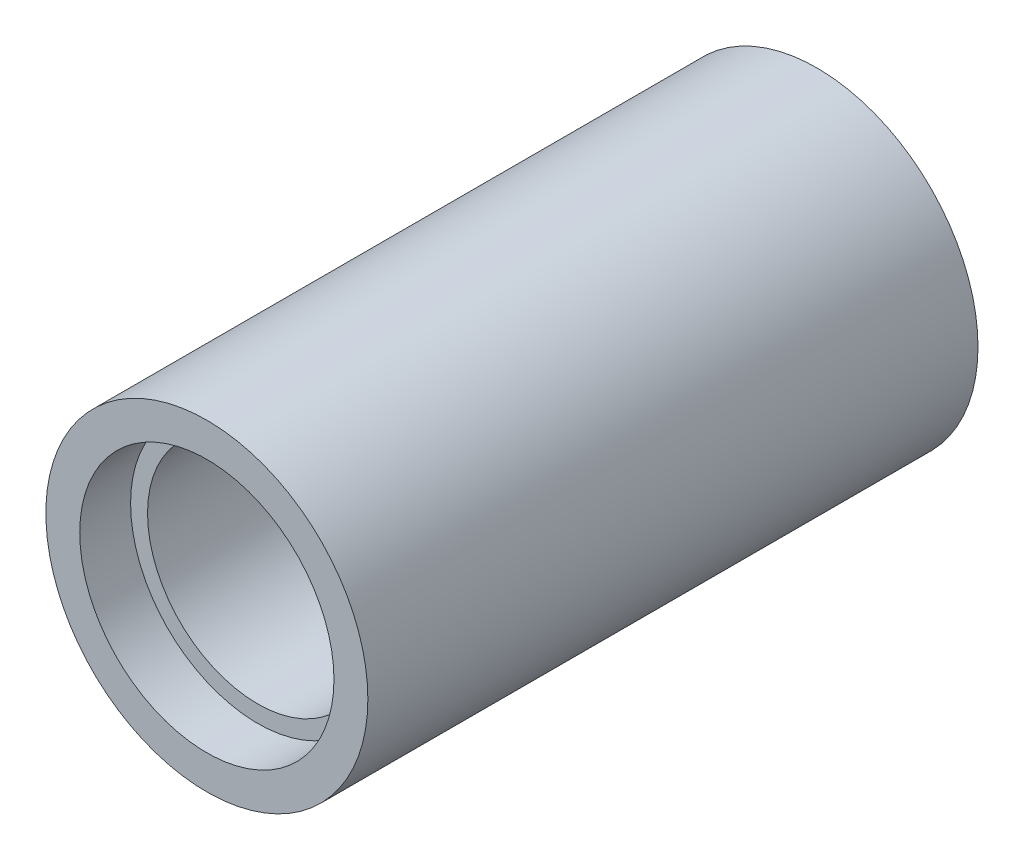
ISO-10303-21;
HEADER;
FILE_DESCRIPTION(('STEP AP214'),'2;1');
FILE_NAME('part.step','',(''),(''),'','','');
FILE_SCHEMA(('AUTOMOTIVE_DESIGN { 1 0 10303 214 1 1 1 1 }'));
ENDSEC;
DATA;
#1=APPLICATION_CONTEXT('core data for automotive mechanical design processes');
#2=APPLICATION_PROTOCOL_DEFINITION('international standard','automotive_design',2000,#1);
#3=PRODUCT_CONTEXT('',#1,'mechanical');
#4=PRODUCT('Part','Part','',(#3));
#5=PRODUCT_RELATED_PRODUCT_CATEGORY('part','',(#4));
#6=PRODUCT_DEFINITION_FORMATION('','',#4);
#7=PRODUCT_DEFINITION_CONTEXT('part definition',#1,'design');
#8=PRODUCT_DEFINITION('design','',#6,#7);
#9=PRODUCT_DEFINITION_SHAPE('','',#8);
#10=(LENGTH_UNIT() NAMED_UNIT(*) SI_UNIT(.MILLI.,.METRE.));
#11=(NAMED_UNIT(*) PLANE_ANGLE_UNIT() SI_UNIT($,.RADIAN.));
#12=(NAMED_UNIT(*) SI_UNIT($,.STERADIAN.) SOLID_ANGLE_UNIT());
#13=UNCERTAINTY_MEASURE_WITH_UNIT(LENGTH_MEASURE(1.E-05),#10,'distance_accuracy_value','');
#14=(GEOMETRIC_REPRESENTATION_CONTEXT(3) GLOBAL_UNCERTAINTY_ASSIGNED_CONTEXT((#13)) GLOBAL_UNIT_ASSIGNED_CONTEXT((#10,
#11,#12)) REPRESENTATION_CONTEXT('',''));
#15=CARTESIAN_POINT('',(0.,0.,0.));
#16=DIRECTION('',(0.,0.,1.));
#17=DIRECTION('',(1.,0.,0.));
#18=AXIS2_PLACEMENT_3D('',#15,#16,#17);
#19=CARTESIAN_POINT('',(0.,7.35,45.));
#20=DIRECTION('',(0.,0.,-1.));
#21=DIRECTION('',(-1.,0.,0.));
#22=AXIS2_PLACEMENT_3D('',#19,#20,#21);
#23=PLANE('',#22);
#24=CARTESIAN_POINT('',(0.,0.,45.));
#25=DIRECTION('',(0.,0.,-1.));
#26=DIRECTION('',(-1.,0.,0.));
#27=AXIS2_PLACEMENT_3D('',#24,#25,#26);
#28=CIRCLE('',#27,6.5);
#29=CARTESIAN_POINT('',(-6.49999999999999,0.,45.));
#30=VERTEX_POINT('',#29);
#31=EDGE_CURVE('E63',#30,#30,#28,.T.);
#32=ORIENTED_EDGE('',*,*,#31,.T.);
#33=EDGE_LOOP('',(#32));
#34=FACE_BOUND('',#33,.T.);
#35=CARTESIAN_POINT('',(0.,0.,45.));
#36=DIRECTION('',(0.,0.,-1.));
#37=DIRECTION('',(-1.,0.,0.));
#38=AXIS2_PLACEMENT_3D('',#35,#36,#37);
#39=CIRCLE('',#38,7.5);
#40=CARTESIAN_POINT('',(-7.49999999999999,0.,45.));
#41=VERTEX_POINT('',#40);
#42=EDGE_CURVE('E10',#41,#41,#39,.T.);
#43=ORIENTED_EDGE('',*,*,#42,.F.);
#44=EDGE_LOOP('',(#43));
#45=FACE_BOUND('',#44,.T.);
#46=ADVANCED_FACE('F39',(#34,#45),#23,.F.);
#47=CARTESIAN_POINT('',(0.,0.,41.8700576850888));
#48=DIRECTION('',(0.,0.,-1.));
#49=DIRECTION('',(-1.,0.,0.));
#50=AXIS2_PLACEMENT_3D('',#47,#48,#49);
#51=CYLINDRICAL_SURFACE('',#50,9.5);
#52=CARTESIAN_POINT('',(0.,0.,12.));
#53=DIRECTION('',(0.,0.,1.));
#54=DIRECTION('',(1.,0.,0.));
#55=AXIS2_PLACEMENT_3D('',#52,#53,#54);
#56=CIRCLE('',#55,9.5);
#57=CARTESIAN_POINT('',(9.50000000000001,0.,12.));
#58=VERTEX_POINT('',#57);
#59=EDGE_CURVE('E47',#58,#58,#56,.T.);
#60=ORIENTED_EDGE('',*,*,#59,.T.);
#61=EDGE_LOOP('',(#60));
#62=FACE_BOUND('',#61,.T.);
#63=CARTESIAN_POINT('',(0.,0.,48.));
#64=DIRECTION('',(0.,0.,1.));
#65=DIRECTION('',(1.,0.,0.));
#66=AXIS2_PLACEMENT_3D('',#63,#64,#65);
#67=CIRCLE('',#66,9.5);
#68=CARTESIAN_POINT('',(9.50000000000001,0.,48.));
#69=VERTEX_POINT('',#68);
#70=EDGE_CURVE('E58',#69,#69,#67,.F.);
#71=ORIENTED_EDGE('',*,*,#70,.T.);
#72=EDGE_LOOP('',(#71));
#73=FACE_BOUND('',#72,.T.);
#74=ADVANCED_FACE('F41',(#62,#73),#51,.T.);
#75=CARTESIAN_POINT('',(0.,0.,12.));
#76=DIRECTION('',(0.,0.,1.));
#77=DIRECTION('',(1.,0.,0.));
#78=AXIS2_PLACEMENT_3D('',#75,#76,#77);
#79=PLANE('',#78);
#80=ORIENTED_EDGE('',*,*,#59,.F.);
#81=EDGE_LOOP('',(#80));
#82=FACE_BOUND('',#81,.T.);
#83=CARTESIAN_POINT('',(0.,0.,12.));
#84=DIRECTION('',(0.,0.,1.));
#85=DIRECTION('',(1.,0.,0.));
#86=AXIS2_PLACEMENT_3D('',#83,#84,#85);
#87=CIRCLE('',#86,7.5);
#88=CARTESIAN_POINT('',(7.50000000000001,0.,12.));
#89=VERTEX_POINT('',#88);
#90=EDGE_CURVE('E52',#89,#89,#87,.T.);
#91=ORIENTED_EDGE('',*,*,#90,.T.);
#92=EDGE_LOOP('',(#91));
#93=FACE_BOUND('',#92,.T.);
#94=ADVANCED_FACE('F87',(#82,#93),#79,.F.);
#95=CARTESIAN_POINT('',(0.,0.,41.8700576850888));
#96=DIRECTION('',(0.,0.,-1.));
#97=DIRECTION('',(-1.,0.,0.));
#98=AXIS2_PLACEMENT_3D('',#95,#96,#97);
#99=CYLINDRICAL_SURFACE('',#98,7.5);
#100=ORIENTED_EDGE('',*,*,#90,.F.);
#101=EDGE_LOOP('',(#100));
#102=FACE_BOUND('',#101,.T.);
#103=CARTESIAN_POINT('',(0.,0.,15.));
#104=DIRECTION('',(0.,0.,1.));
#105=DIRECTION('',(1.,0.,0.));
#106=AXIS2_PLACEMENT_3D('',#103,#104,#105);
#107=CIRCLE('',#106,7.5);
#108=CARTESIAN_POINT('',(7.50000000000001,0.,15.));
#109=VERTEX_POINT('',#108);
#110=EDGE_CURVE('E43',#109,#109,#107,.T.);
#111=ORIENTED_EDGE('',*,*,#110,.T.);
#112=EDGE_LOOP('',(#111));
#113=FACE_BOUND('',#112,.T.);
#114=ADVANCED_FACE('F72',(#102,#113),#99,.F.);
#115=CARTESIAN_POINT('',(0.,0.,15.));
#116=DIRECTION('',(0.,0.,1.));
#117=DIRECTION('',(1.,0.,0.));
#118=AXIS2_PLACEMENT_3D('',#115,#116,#117);
#119=PLANE('',#118);
#120=CARTESIAN_POINT('',(0.,0.,15.));
#121=DIRECTION('',(0.,0.,1.));
#122=DIRECTION('',(1.,0.,0.));
#123=AXIS2_PLACEMENT_3D('',#120,#121,#122);
#124=CIRCLE('',#123,6.5);
#125=CARTESIAN_POINT('',(6.50000000000001,0.,15.));
#126=VERTEX_POINT('',#125);
#127=EDGE_CURVE('E57',#126,#126,#124,.T.);
#128=ORIENTED_EDGE('',*,*,#127,.T.);
#129=EDGE_LOOP('',(#128));
#130=FACE_BOUND('',#129,.T.);
#131=ORIENTED_EDGE('',*,*,#110,.F.);
#132=EDGE_LOOP('',(#131));
#133=FACE_BOUND('',#132,.T.);
#134=ADVANCED_FACE('F74',(#130,#133),#119,.F.);
#135=CARTESIAN_POINT('',(0.,0.,71.8700576850888));
#136=DIRECTION('',(0.,0.,-1.));
#137=DIRECTION('',(-1.,0.,0.));
#138=AXIS2_PLACEMENT_3D('',#135,#136,#137);
#139=CYLINDRICAL_SURFACE('',#138,6.5);
#140=ORIENTED_EDGE('',*,*,#31,.F.);
#141=EDGE_LOOP('',(#140));
#142=FACE_BOUND('',#141,.T.);
#143=ORIENTED_EDGE('',*,*,#127,.F.);
#144=EDGE_LOOP('',(#143));
#145=FACE_BOUND('',#144,.T.);
#146=ADVANCED_FACE('F76',(#142,#145),#139,.F.);
#147=CARTESIAN_POINT('',(0.,0.,74.8700576850888));
#148=DIRECTION('',(0.,0.,-1.));
#149=DIRECTION('',(-1.,0.,0.));
#150=AXIS2_PLACEMENT_3D('',#147,#148,#149);
#151=CYLINDRICAL_SURFACE('',#150,7.5);
#152=ORIENTED_EDGE('',*,*,#42,.T.);
#153=EDGE_LOOP('',(#152));
#154=FACE_BOUND('',#153,.T.);
#155=CARTESIAN_POINT('',(0.,0.,48.));
#156=DIRECTION('',(0.,0.,1.));
#157=DIRECTION('',(1.,0.,0.));
#158=AXIS2_PLACEMENT_3D('',#155,#156,#157);
#159=CIRCLE('',#158,7.5);
#160=CARTESIAN_POINT('',(7.50000000000001,0.,48.));
#161=VERTEX_POINT('',#160);
#162=EDGE_CURVE('E54',#161,#161,#159,.F.);
#163=ORIENTED_EDGE('',*,*,#162,.F.);
#164=EDGE_LOOP('',(#163));
#165=FACE_BOUND('',#164,.T.);
#166=ADVANCED_FACE('F84',(#154,#165),#151,.F.);
#167=CARTESIAN_POINT('',(0.,6.85,48.));
#168=DIRECTION('',(0.,0.,1.));
#169=DIRECTION('',(1.,0.,0.));
#170=AXIS2_PLACEMENT_3D('',#167,#168,#169);
#171=PLANE('',#170);
#172=ORIENTED_EDGE('',*,*,#70,.F.);
#173=EDGE_LOOP('',(#172));
#174=FACE_BOUND('',#173,.T.);
#175=ORIENTED_EDGE('',*,*,#162,.T.);
#176=EDGE_LOOP('',(#175));
#177=FACE_BOUND('',#176,.T.);
#178=ADVANCED_FACE('F110',(#174,#177),#171,.T.);
#179=CLOSED_SHELL('',(#46,#74,#94,#114,#134,#146,#166,#178));
#180=MANIFOLD_SOLID_BREP('B2',#179);
#181=ADVANCED_BREP_SHAPE_REPRESENTATION('',(#18,#180),#14);
#182=SHAPE_DEFINITION_REPRESENTATION(#9,#181);
ENDSEC;
END-ISO-10303-21;
